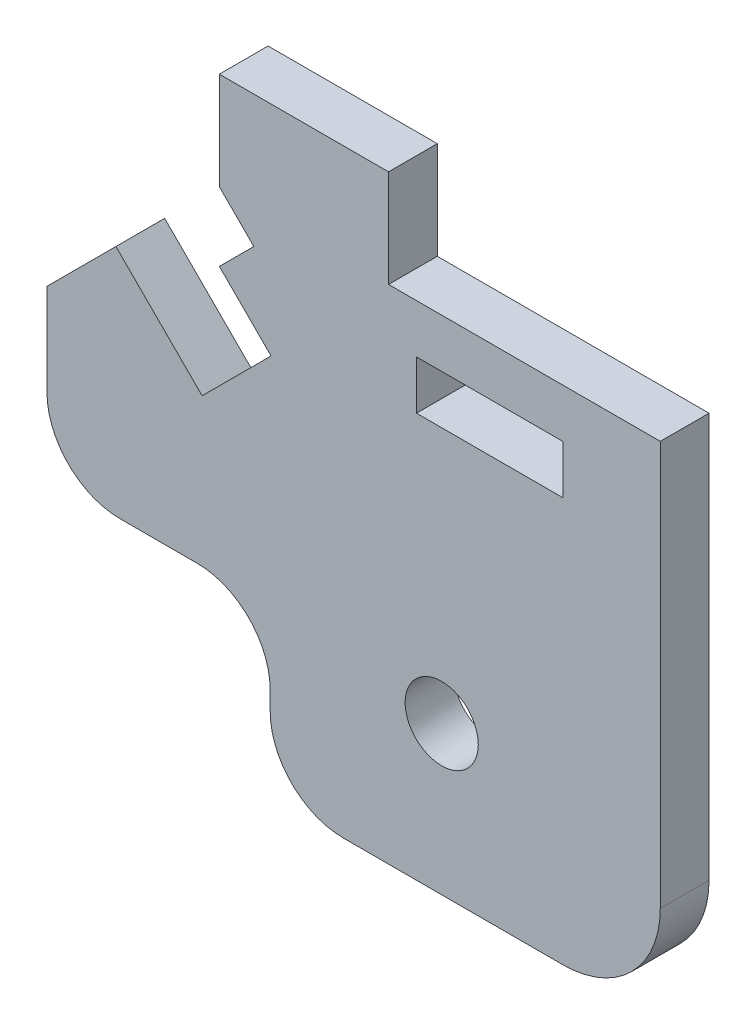
ISO-10303-21;
HEADER;
FILE_DESCRIPTION(('STEP AP214'),'2;1');
FILE_NAME('part.step','',(''),(''),'','','');
FILE_SCHEMA(('AUTOMOTIVE_DESIGN { 1 0 10303 214 1 1 1 1 }'));
ENDSEC;
DATA;
#1=APPLICATION_CONTEXT('core data for automotive mechanical design processes');
#2=APPLICATION_PROTOCOL_DEFINITION('international standard','automotive_design',2000,#1);
#3=PRODUCT_CONTEXT('',#1,'mechanical');
#4=PRODUCT('Part','Part','',(#3));
#5=PRODUCT_RELATED_PRODUCT_CATEGORY('part','',(#4));
#6=PRODUCT_DEFINITION_FORMATION('','',#4);
#7=PRODUCT_DEFINITION_CONTEXT('part definition',#1,'design');
#8=PRODUCT_DEFINITION('design','',#6,#7);
#9=PRODUCT_DEFINITION_SHAPE('','',#8);
#10=(LENGTH_UNIT() NAMED_UNIT(*) SI_UNIT(.MILLI.,.METRE.));
#11=(NAMED_UNIT(*) PLANE_ANGLE_UNIT() SI_UNIT($,.RADIAN.));
#12=(NAMED_UNIT(*) SI_UNIT($,.STERADIAN.) SOLID_ANGLE_UNIT());
#13=UNCERTAINTY_MEASURE_WITH_UNIT(LENGTH_MEASURE(1.E-05),#10,'distance_accuracy_value','');
#14=(GEOMETRIC_REPRESENTATION_CONTEXT(3) GLOBAL_UNCERTAINTY_ASSIGNED_CONTEXT((#13)) GLOBAL_UNIT_ASSIGNED_CONTEXT((#10,
#11,#12)) REPRESENTATION_CONTEXT('',''));
#15=CARTESIAN_POINT('',(0.,0.,0.));
#16=DIRECTION('',(0.,0.,1.));
#17=DIRECTION('',(1.,0.,0.));
#18=AXIS2_PLACEMENT_3D('',#15,#16,#17);
#19=CARTESIAN_POINT('',(21.1568542494928,-7.64136258524606,2.));
#20=DIRECTION('',(0.,0.,1.));
#21=DIRECTION('',(1.,0.,0.));
#22=AXIS2_PLACEMENT_3D('',#19,#20,#21);
#23=PLANE('',#22);
#24=DIRECTION('',(-0.707106781186547,0.707106781186548,0.));
#25=VECTOR('',#24,1.);
#26=CARTESIAN_POINT('',(9.19238815542473,3.99999999999929,2.));
#27=LINE('',#26,#25);
#28=CARTESIAN_POINT('',(9.19238815542473,3.99999999999929,2.));
#29=VERTEX_POINT('',#28);
#30=CARTESIAN_POINT('',(7.07106781186523,6.12132034355878,2.));
#31=VERTEX_POINT('',#30);
#32=EDGE_CURVE('E211',#29,#31,#27,.T.);
#33=ORIENTED_EDGE('',*,*,#32,.F.);
#34=DIRECTION('',(-0.707106781186548,-0.707106781186548,0.));
#35=VECTOR('',#34,1.);
#36=CARTESIAN_POINT('',(6.36396103067849,1.17157287525305,2.));
#37=LINE('',#36,#35);
#38=CARTESIAN_POINT('',(6.36396103067849,1.17157287525305,2.));
#39=VERTEX_POINT('',#38);
#40=EDGE_CURVE('E208',#29,#39,#37,.T.);
#41=ORIENTED_EDGE('',*,*,#40,.T.);
#42=DIRECTION('',(-0.707106781186547,0.707106781186547,0.));
#43=VECTOR('',#42,1.);
#44=CARTESIAN_POINT('',(6.36396103067849,1.17157287525305,2.));
#45=LINE('',#44,#43);
#46=CARTESIAN_POINT('',(2.82842712474585,4.70710678118569,2.));
#47=VERTEX_POINT('',#46);
#48=EDGE_CURVE('E272',#39,#47,#45,.T.);
#49=ORIENTED_EDGE('',*,*,#48,.T.);
#50=DIRECTION('',(-0.707106781186547,-0.707106781186548,0.));
#51=VECTOR('',#50,1.);
#52=CARTESIAN_POINT('',(2.82842712474585,4.70710678118569,2.));
#53=LINE('',#52,#51);
#54=CARTESIAN_POINT('',(-2.66063213127943E-13,1.87867965643957,2.));
#55=VERTEX_POINT('',#54);
#56=EDGE_CURVE('E274',#47,#55,#53,.T.);
#57=ORIENTED_EDGE('',*,*,#56,.T.);
#58=DIRECTION('',(0.,-1.,0.));
#59=VECTOR('',#58,1.);
#60=CARTESIAN_POINT('',(-2.65846372693446E-13,-1.87867965643967,2.));
#61=LINE('',#60,#59);
#62=CARTESIAN_POINT('',(-2.65846372693446E-13,-1.87867965643967,2.));
#63=VERTEX_POINT('',#62);
#64=EDGE_CURVE('E276',#55,#63,#61,.T.);
#65=ORIENTED_EDGE('',*,*,#64,.T.);
#66=CARTESIAN_POINT('',(2.99999999999963,-1.87867965643967,2.));
#67=DIRECTION('',(0.,0.,1.));
#68=DIRECTION('',(1.,0.,0.));
#69=AXIS2_PLACEMENT_3D('',#66,#67,#68);
#70=CIRCLE('',#69,2.99999999999989);
#71=CARTESIAN_POINT('',(2.99999999999963,-4.87867965643956,2.));
#72=VERTEX_POINT('',#71);
#73=EDGE_CURVE('E278',#63,#72,#70,.T.);
#74=ORIENTED_EDGE('',*,*,#73,.T.);
#75=DIRECTION('',(1.,0.,0.));
#76=VECTOR('',#75,1.);
#77=CARTESIAN_POINT('',(2.99999999999963,-4.87867965643956,2.));
#78=LINE('',#77,#76);
#79=CARTESIAN_POINT('',(6.15685424949204,-4.87867965643943,2.));
#80=VERTEX_POINT('',#79);
#81=EDGE_CURVE('E280',#72,#80,#78,.T.);
#82=ORIENTED_EDGE('',*,*,#81,.T.);
#83=CARTESIAN_POINT('',(6.15685424949178,-7.87867965643945,2.));
#84=DIRECTION('',(0.,0.,-1.));
#85=DIRECTION('',(1.,0.,0.));
#86=AXIS2_PLACEMENT_3D('',#83,#84,#85);
#87=CIRCLE('',#86,3.00000000000002);
#88=CARTESIAN_POINT('',(9.15685424949193,-7.87867965643945,2.));
#89=VERTEX_POINT('',#88);
#90=EDGE_CURVE('E282',#80,#89,#87,.T.);
#91=ORIENTED_EDGE('',*,*,#90,.T.);
#92=DIRECTION('',(0.,-1.,0.));
#93=VECTOR('',#92,1.);
#94=CARTESIAN_POINT('',(9.15685424949193,-8.64136258524606,2.));
#95=LINE('',#94,#93);
#96=CARTESIAN_POINT('',(9.15685424949193,-8.64136258524606,2.));
#97=VERTEX_POINT('',#96);
#98=EDGE_CURVE('E284',#89,#97,#95,.T.);
#99=ORIENTED_EDGE('',*,*,#98,.T.);
#100=CARTESIAN_POINT('',(12.1568542494918,-8.64136258524606,2.));
#101=DIRECTION('',(0.,0.,1.));
#102=DIRECTION('',(1.,0.,0.));
#103=AXIS2_PLACEMENT_3D('',#100,#101,#102);
#104=CIRCLE('',#103,2.99999999999989);
#105=CARTESIAN_POINT('',(12.1568542494918,-11.641362585246,2.));
#106=VERTEX_POINT('',#105);
#107=EDGE_CURVE('E286',#97,#106,#104,.T.);
#108=ORIENTED_EDGE('',*,*,#107,.T.);
#109=DIRECTION('',(1.,0.,0.));
#110=VECTOR('',#109,1.);
#111=CARTESIAN_POINT('',(21.1568542494928,-11.641362585246,2.));
#112=LINE('',#111,#110);
#113=CARTESIAN_POINT('',(21.1568542494928,-11.641362585246,2.));
#114=VERTEX_POINT('',#113);
#115=EDGE_CURVE('E288',#106,#114,#112,.T.);
#116=ORIENTED_EDGE('',*,*,#115,.T.);
#117=CARTESIAN_POINT('',(21.1568542494928,-7.64136258524606,2.));
#118=DIRECTION('',(0.,0.,1.));
#119=DIRECTION('',(1.,0.,0.));
#120=AXIS2_PLACEMENT_3D('',#117,#118,#119);
#121=CIRCLE('',#120,3.99999999999989);
#122=CARTESIAN_POINT('',(25.1568542494927,-7.64136258524606,2.));
#123=VERTEX_POINT('',#122);
#124=EDGE_CURVE('E252',#114,#123,#121,.T.);
#125=ORIENTED_EDGE('',*,*,#124,.T.);
#126=DIRECTION('',(0.,1.,0.));
#127=VECTOR('',#126,1.);
#128=CARTESIAN_POINT('',(25.1568542494924,8.94974746830488,2.));
#129=LINE('',#128,#127);
#130=CARTESIAN_POINT('',(25.1568542494924,8.94974746830488,2.));
#131=VERTEX_POINT('',#130);
#132=EDGE_CURVE('E255',#123,#131,#129,.T.);
#133=ORIENTED_EDGE('',*,*,#132,.T.);
#134=DIRECTION('',(-1.,0.,0.));
#135=VECTOR('',#134,1.);
#136=CARTESIAN_POINT('',(14.0104076400849,8.94974746830495,2.));
#137=LINE('',#136,#135);
#138=CARTESIAN_POINT('',(14.0104076400849,8.94974746830495,2.));
#139=VERTEX_POINT('',#138);
#140=EDGE_CURVE('E258',#131,#139,#137,.T.);
#141=ORIENTED_EDGE('',*,*,#140,.T.);
#142=DIRECTION('',(0.,1.,0.));
#143=VECTOR('',#142,1.);
#144=CARTESIAN_POINT('',(14.0104076400849,8.94974746830495,2.));
#145=LINE('',#144,#143);
#146=CARTESIAN_POINT('',(14.0104076400849,12.9497474683048,2.));
#147=VERTEX_POINT('',#146);
#148=EDGE_CURVE('E260',#139,#147,#145,.T.);
#149=ORIENTED_EDGE('',*,*,#148,.T.);
#150=DIRECTION('',(-1.,0.,0.));
#151=VECTOR('',#150,1.);
#152=CARTESIAN_POINT('',(7.07106781186511,12.9497474683048,2.));
#153=LINE('',#152,#151);
#154=CARTESIAN_POINT('',(7.07106781186511,12.9497474683048,2.));
#155=VERTEX_POINT('',#154);
#156=EDGE_CURVE('E262',#147,#155,#153,.T.);
#157=ORIENTED_EDGE('',*,*,#156,.T.);
#158=DIRECTION('',(0.,-1.,0.));
#159=VECTOR('',#158,1.);
#160=CARTESIAN_POINT('',(7.07106781186511,8.94974746830495,2.));
#161=LINE('',#160,#159);
#162=CARTESIAN_POINT('',(7.07106781186511,8.94974746830495,2.));
#163=VERTEX_POINT('',#162);
#164=EDGE_CURVE('E264',#155,#163,#161,.T.);
#165=ORIENTED_EDGE('',*,*,#164,.T.);
#166=DIRECTION('',(0.707106781186548,-0.707106781186547,0.));
#167=VECTOR('',#166,1.);
#168=CARTESIAN_POINT('',(8.48528137423825,7.5355339059318,2.));
#169=LINE('',#168,#167);
#170=CARTESIAN_POINT('',(8.48528137423825,7.5355339059318,2.));
#171=VERTEX_POINT('',#170);
#172=EDGE_CURVE('E266',#163,#171,#169,.T.);
#173=ORIENTED_EDGE('',*,*,#172,.T.);
#174=DIRECTION('',(-0.707106781186547,-0.707106781186547,0.));
#175=VECTOR('',#174,1.);
#176=CARTESIAN_POINT('',(5.65685424949214,4.70710678118569,2.));
#177=LINE('',#176,#175);
#178=EDGE_CURVE('E268',#171,#31,#177,.T.);
#179=ORIENTED_EDGE('',*,*,#178,.T.);
#180=EDGE_LOOP('',(#33,#41,#49,#57,#65,#74,#82,#91,#99,#108,#116,#125,#133,#141,#149,#157,#165,
#173,#179));
#181=FACE_BOUND('',#180,.T.);
#182=CARTESIAN_POINT('',(16.1916874142971,-5.55894635070797,2.));
#183=DIRECTION('',(0.,0.,1.));
#184=DIRECTION('',(1.,0.,0.));
#185=AXIS2_PLACEMENT_3D('',#182,#183,#184);
#186=CIRCLE('',#185,1.50000000000006);
#187=CARTESIAN_POINT('',(17.6916874142972,-5.55894635070797,2.));
#188=VERTEX_POINT('',#187);
#189=EDGE_CURVE('E246',#188,#188,#186,.T.);
#190=ORIENTED_EDGE('',*,*,#189,.F.);
#191=EDGE_LOOP('',(#190));
#192=FACE_BOUND('',#191,.T.);
#193=DIRECTION('',(-1.31838984174245E-13,1.,0.));
#194=VECTOR('',#193,1.);
#195=CARTESIAN_POINT('',(21.1568542494928,4.94974746830634,2.));
#196=LINE('',#195,#194);
#197=CARTESIAN_POINT('',(21.1568542494928,4.94974746830634,2.));
#198=VERTEX_POINT('',#197);
#199=CARTESIAN_POINT('',(21.1568542494925,6.94974746830622,2.));
#200=VERTEX_POINT('',#199);
#201=EDGE_CURVE('E222',#198,#200,#196,.T.);
#202=ORIENTED_EDGE('',*,*,#201,.F.);
#203=DIRECTION('',(1.,0.,0.));
#204=VECTOR('',#203,1.);
#205=CARTESIAN_POINT('',(21.1568542494928,4.94974746830634,2.));
#206=LINE('',#205,#204);
#207=CARTESIAN_POINT('',(15.1568542494917,4.94974746830634,2.));
#208=VERTEX_POINT('',#207);
#209=EDGE_CURVE('E220',#208,#198,#206,.T.);
#210=ORIENTED_EDGE('',*,*,#209,.F.);
#211=DIRECTION('',(-1.31838984174245E-13,-1.,0.));
#212=VECTOR('',#211,1.);
#213=CARTESIAN_POINT('',(15.1568542494917,4.94974746830634,2.));
#214=LINE('',#213,#212);
#215=CARTESIAN_POINT('',(15.156854249492,6.94974746830622,2.));
#216=VERTEX_POINT('',#215);
#217=EDGE_CURVE('E227',#216,#208,#214,.T.);
#218=ORIENTED_EDGE('',*,*,#217,.F.);
#219=DIRECTION('',(-1.,0.,0.));
#220=VECTOR('',#219,1.);
#221=CARTESIAN_POINT('',(15.156854249492,6.94974746830622,2.));
#222=LINE('',#221,#220);
#223=EDGE_CURVE('E225',#200,#216,#222,.T.);
#224=ORIENTED_EDGE('',*,*,#223,.F.);
#225=EDGE_LOOP('',(#202,#210,#218,#224));
#226=FACE_BOUND('',#225,.T.);
#227=ADVANCED_FACE('F33',(#181,#192,#226),#23,.T.);
#228=CARTESIAN_POINT('',(21.1568542494928,-7.64136258524606,0.));
#229=DIRECTION('',(0.,0.,1.));
#230=DIRECTION('',(1.,0.,0.));
#231=AXIS2_PLACEMENT_3D('',#228,#229,#230);
#232=PLANE('',#231);
#233=CARTESIAN_POINT('',(16.1916874142971,-5.55894635070797,0.));
#234=DIRECTION('',(0.,0.,1.));
#235=DIRECTION('',(1.,0.,0.));
#236=AXIS2_PLACEMENT_3D('',#233,#234,#235);
#237=CIRCLE('',#236,1.50000000000006);
#238=CARTESIAN_POINT('',(17.6916874142972,-5.55894635070797,0.));
#239=VERTEX_POINT('',#238);
#240=EDGE_CURVE('E245',#239,#239,#237,.T.);
#241=ORIENTED_EDGE('',*,*,#240,.T.);
#242=EDGE_LOOP('',(#241));
#243=FACE_BOUND('',#242,.T.);
#244=DIRECTION('',(-0.707106781186548,-0.707106781186548,0.));
#245=VECTOR('',#244,1.);
#246=CARTESIAN_POINT('',(6.36396103067849,1.17157287525305,0.));
#247=LINE('',#246,#245);
#248=CARTESIAN_POINT('',(9.19238815542473,3.99999999999929,0.));
#249=VERTEX_POINT('',#248);
#250=CARTESIAN_POINT('',(6.36396103067849,1.17157287525305,0.));
#251=VERTEX_POINT('',#250);
#252=EDGE_CURVE('E190',#249,#251,#247,.T.);
#253=ORIENTED_EDGE('',*,*,#252,.F.);
#254=DIRECTION('',(0.707106781186547,-0.707106781186548,0.));
#255=VECTOR('',#254,1.);
#256=CARTESIAN_POINT('',(9.19238815542473,3.99999999999929,0.));
#257=LINE('',#256,#255);
#258=CARTESIAN_POINT('',(7.07106781186523,6.12132034355878,0.));
#259=VERTEX_POINT('',#258);
#260=EDGE_CURVE('E196',#259,#249,#257,.T.);
#261=ORIENTED_EDGE('',*,*,#260,.F.);
#262=DIRECTION('',(-0.707106781186547,-0.707106781186547,0.));
#263=VECTOR('',#262,1.);
#264=CARTESIAN_POINT('',(5.65685424949214,4.70710678118569,0.));
#265=LINE('',#264,#263);
#266=CARTESIAN_POINT('',(8.48528137423825,7.5355339059318,0.));
#267=VERTEX_POINT('',#266);
#268=EDGE_CURVE('E203',#267,#259,#265,.T.);
#269=ORIENTED_EDGE('',*,*,#268,.F.);
#270=DIRECTION('',(0.707106781186548,-0.707106781186547,0.));
#271=VECTOR('',#270,1.);
#272=CARTESIAN_POINT('',(8.48528137423825,7.5355339059318,0.));
#273=LINE('',#272,#271);
#274=CARTESIAN_POINT('',(7.07106781186511,8.94974746830495,0.));
#275=VERTEX_POINT('',#274);
#276=EDGE_CURVE('E303',#275,#267,#273,.T.);
#277=ORIENTED_EDGE('',*,*,#276,.F.);
#278=DIRECTION('',(0.,-1.,0.));
#279=VECTOR('',#278,1.);
#280=CARTESIAN_POINT('',(7.07106781186511,8.94974746830495,0.));
#281=LINE('',#280,#279);
#282=CARTESIAN_POINT('',(7.07106781186511,12.9497474683048,0.));
#283=VERTEX_POINT('',#282);
#284=EDGE_CURVE('E301',#283,#275,#281,.T.);
#285=ORIENTED_EDGE('',*,*,#284,.F.);
#286=DIRECTION('',(-1.,0.,0.));
#287=VECTOR('',#286,1.);
#288=CARTESIAN_POINT('',(7.07106781186511,12.9497474683048,0.));
#289=LINE('',#288,#287);
#290=CARTESIAN_POINT('',(14.0104076400849,12.9497474683048,0.));
#291=VERTEX_POINT('',#290);
#292=EDGE_CURVE('E299',#291,#283,#289,.T.);
#293=ORIENTED_EDGE('',*,*,#292,.F.);
#294=DIRECTION('',(0.,1.,0.));
#295=VECTOR('',#294,1.);
#296=CARTESIAN_POINT('',(14.0104076400849,8.94974746830495,0.));
#297=LINE('',#296,#295);
#298=CARTESIAN_POINT('',(14.0104076400849,8.94974746830495,0.));
#299=VERTEX_POINT('',#298);
#300=EDGE_CURVE('E297',#299,#291,#297,.T.);
#301=ORIENTED_EDGE('',*,*,#300,.F.);
#302=DIRECTION('',(-1.,0.,0.));
#303=VECTOR('',#302,1.);
#304=CARTESIAN_POINT('',(14.0104076400849,8.94974746830495,0.));
#305=LINE('',#304,#303);
#306=CARTESIAN_POINT('',(25.1568542494924,8.94974746830488,0.));
#307=VERTEX_POINT('',#306);
#308=EDGE_CURVE('E295',#307,#299,#305,.T.);
#309=ORIENTED_EDGE('',*,*,#308,.F.);
#310=DIRECTION('',(0.,1.,0.));
#311=VECTOR('',#310,1.);
#312=CARTESIAN_POINT('',(25.1568542494924,8.94974746830488,0.));
#313=LINE('',#312,#311);
#314=CARTESIAN_POINT('',(25.1568542494927,-7.64136258524606,0.));
#315=VERTEX_POINT('',#314);
#316=EDGE_CURVE('E293',#315,#307,#313,.T.);
#317=ORIENTED_EDGE('',*,*,#316,.F.);
#318=CARTESIAN_POINT('',(21.1568542494928,-7.64136258524606,0.));
#319=DIRECTION('',(0.,0.,1.));
#320=DIRECTION('',(1.,0.,0.));
#321=AXIS2_PLACEMENT_3D('',#318,#319,#320);
#322=CIRCLE('',#321,3.99999999999989);
#323=CARTESIAN_POINT('',(21.1568542494928,-11.641362585246,0.));
#324=VERTEX_POINT('',#323);
#325=EDGE_CURVE('E249',#324,#315,#322,.T.);
#326=ORIENTED_EDGE('',*,*,#325,.F.);
#327=DIRECTION('',(1.,0.,0.));
#328=VECTOR('',#327,1.);
#329=CARTESIAN_POINT('',(21.1568542494928,-11.641362585246,0.));
#330=LINE('',#329,#328);
#331=CARTESIAN_POINT('',(12.1568542494918,-11.641362585246,0.));
#332=VERTEX_POINT('',#331);
#333=EDGE_CURVE('E256',#332,#324,#330,.T.);
#334=ORIENTED_EDGE('',*,*,#333,.F.);
#335=CARTESIAN_POINT('',(12.1568542494918,-8.64136258524606,0.));
#336=DIRECTION('',(0.,0.,1.));
#337=DIRECTION('',(1.,0.,0.));
#338=AXIS2_PLACEMENT_3D('',#335,#336,#337);
#339=CIRCLE('',#338,2.99999999999989);
#340=CARTESIAN_POINT('',(9.15685424949193,-8.64136258524606,0.));
#341=VERTEX_POINT('',#340);
#342=EDGE_CURVE('E320',#341,#332,#339,.T.);
#343=ORIENTED_EDGE('',*,*,#342,.F.);
#344=DIRECTION('',(0.,-1.,0.));
#345=VECTOR('',#344,1.);
#346=CARTESIAN_POINT('',(9.15685424949193,-8.64136258524606,0.));
#347=LINE('',#346,#345);
#348=CARTESIAN_POINT('',(9.15685424949193,-7.87867965643945,0.));
#349=VERTEX_POINT('',#348);
#350=EDGE_CURVE('E318',#349,#341,#347,.T.);
#351=ORIENTED_EDGE('',*,*,#350,.F.);
#352=CARTESIAN_POINT('',(6.15685424949178,-7.87867965643945,0.));
#353=DIRECTION('',(0.,0.,-1.));
#354=DIRECTION('',(1.,0.,0.));
#355=AXIS2_PLACEMENT_3D('',#352,#353,#354);
#356=CIRCLE('',#355,3.00000000000002);
#357=CARTESIAN_POINT('',(6.15685424949204,-4.87867965643943,0.));
#358=VERTEX_POINT('',#357);
#359=EDGE_CURVE('E316',#358,#349,#356,.T.);
#360=ORIENTED_EDGE('',*,*,#359,.F.);
#361=DIRECTION('',(1.,0.,0.));
#362=VECTOR('',#361,1.);
#363=CARTESIAN_POINT('',(6.15685424949204,-4.87867965643956,0.));
#364=LINE('',#363,#362);
#365=CARTESIAN_POINT('',(2.99999999999963,-4.87867965643956,0.));
#366=VERTEX_POINT('',#365);
#367=EDGE_CURVE('E314',#366,#358,#364,.T.);
#368=ORIENTED_EDGE('',*,*,#367,.F.);
#369=CARTESIAN_POINT('',(2.99999999999963,-1.87867965643967,0.));
#370=DIRECTION('',(0.,0.,1.));
#371=DIRECTION('',(1.,0.,0.));
#372=AXIS2_PLACEMENT_3D('',#369,#370,#371);
#373=CIRCLE('',#372,2.99999999999989);
#374=CARTESIAN_POINT('',(-2.65846372693446E-13,-1.87867965643967,0.));
#375=VERTEX_POINT('',#374);
#376=EDGE_CURVE('E311',#375,#366,#373,.T.);
#377=ORIENTED_EDGE('',*,*,#376,.F.);
#378=DIRECTION('',(0.,-1.,0.));
#379=VECTOR('',#378,1.);
#380=CARTESIAN_POINT('',(-2.65846372693446E-13,-1.87867965643967,0.));
#381=LINE('',#380,#379);
#382=CARTESIAN_POINT('',(-2.66063213127943E-13,1.87867965643957,0.));
#383=VERTEX_POINT('',#382);
#384=EDGE_CURVE('E309',#383,#375,#381,.T.);
#385=ORIENTED_EDGE('',*,*,#384,.F.);
#386=DIRECTION('',(-0.707106781186547,-0.707106781186548,0.));
#387=VECTOR('',#386,1.);
#388=CARTESIAN_POINT('',(2.82842712474585,4.70710678118569,0.));
#389=LINE('',#388,#387);
#390=CARTESIAN_POINT('',(2.82842712474585,4.70710678118569,0.));
#391=VERTEX_POINT('',#390);
#392=EDGE_CURVE('E307',#391,#383,#389,.T.);
#393=ORIENTED_EDGE('',*,*,#392,.F.);
#394=DIRECTION('',(-0.707106781186547,0.707106781186547,0.));
#395=VECTOR('',#394,1.);
#396=CARTESIAN_POINT('',(6.36396103067849,1.17157287525305,0.));
#397=LINE('',#396,#395);
#398=EDGE_CURVE('E199',#251,#391,#397,.T.);
#399=ORIENTED_EDGE('',*,*,#398,.F.);
#400=EDGE_LOOP('',(#253,#261,#269,#277,#285,#293,#301,#309,#317,#326,#334,#343,#351,#360,#368,
#377,#385,#393,#399));
#401=FACE_BOUND('',#400,.T.);
#402=DIRECTION('',(1.,0.,0.));
#403=VECTOR('',#402,1.);
#404=CARTESIAN_POINT('',(21.1568542494928,4.94974746830634,0.));
#405=LINE('',#404,#403);
#406=CARTESIAN_POINT('',(15.1568542494917,4.94974746830634,0.));
#407=VERTEX_POINT('',#406);
#408=CARTESIAN_POINT('',(21.1568542494928,4.94974746830634,0.));
#409=VERTEX_POINT('',#408);
#410=EDGE_CURVE('E56',#407,#409,#405,.T.);
#411=ORIENTED_EDGE('',*,*,#410,.T.);
#412=DIRECTION('',(-1.31838984174245E-13,1.,0.));
#413=VECTOR('',#412,1.);
#414=CARTESIAN_POINT('',(21.1568542494928,4.94974746830634,0.));
#415=LINE('',#414,#413);
#416=CARTESIAN_POINT('',(21.1568542494925,6.94974746830622,0.));
#417=VERTEX_POINT('',#416);
#418=EDGE_CURVE('E231',#409,#417,#415,.T.);
#419=ORIENTED_EDGE('',*,*,#418,.T.);
#420=DIRECTION('',(-1.,0.,0.));
#421=VECTOR('',#420,1.);
#422=CARTESIAN_POINT('',(15.156854249492,6.94974746830622,0.));
#423=LINE('',#422,#421);
#424=CARTESIAN_POINT('',(15.156854249492,6.94974746830622,0.));
#425=VERTEX_POINT('',#424);
#426=EDGE_CURVE('E234',#417,#425,#423,.T.);
#427=ORIENTED_EDGE('',*,*,#426,.T.);
#428=DIRECTION('',(-1.31838984174245E-13,-1.,0.));
#429=VECTOR('',#428,1.);
#430=CARTESIAN_POINT('',(15.1568542494917,4.94974746830634,0.));
#431=LINE('',#430,#429);
#432=EDGE_CURVE('E223',#425,#407,#431,.T.);
#433=ORIENTED_EDGE('',*,*,#432,.T.);
#434=EDGE_LOOP('',(#411,#419,#427,#433));
#435=FACE_BOUND('',#434,.T.);
#436=ADVANCED_FACE('F192',(#243,#401,#435),#232,.F.);
#437=CARTESIAN_POINT('',(21.1568542494928,-7.64136258524606,2.));
#438=DIRECTION('',(0.,0.,-1.));
#439=DIRECTION('',(-1.,0.,0.));
#440=AXIS2_PLACEMENT_3D('',#437,#438,#439);
#441=CYLINDRICAL_SURFACE('',#440,3.99999999999989);
#442=ORIENTED_EDGE('',*,*,#325,.T.);
#443=DIRECTION('',(0.,0.,-1.));
#444=VECTOR('',#443,1.);
#445=CARTESIAN_POINT('',(25.1568542494927,-7.64136258524606,2.));
#446=LINE('',#445,#444);
#447=EDGE_CURVE('E11',#123,#315,#446,.T.);
#448=ORIENTED_EDGE('',*,*,#447,.F.);
#449=ORIENTED_EDGE('',*,*,#124,.F.);
#450=DIRECTION('',(0.,0.,-1.));
#451=VECTOR('',#450,1.);
#452=CARTESIAN_POINT('',(21.1568542494928,-11.641362585246,2.));
#453=LINE('',#452,#451);
#454=EDGE_CURVE('E290',#114,#324,#453,.T.);
#455=ORIENTED_EDGE('',*,*,#454,.T.);
#456=EDGE_LOOP('',(#442,#448,#449,#455));
#457=FACE_BOUND('',#456,.T.);
#458=ADVANCED_FACE('F35',(#457),#441,.T.);
#459=CARTESIAN_POINT('',(25.1568542494924,8.94974746830488,2.));
#460=DIRECTION('',(-1.,0.,0.));
#461=DIRECTION('',(0.,-1.,0.));
#462=AXIS2_PLACEMENT_3D('',#459,#460,#461);
#463=PLANE('',#462);
#464=ORIENTED_EDGE('',*,*,#316,.T.);
#465=DIRECTION('',(0.,0.,-1.));
#466=VECTOR('',#465,1.);
#467=CARTESIAN_POINT('',(25.1568542494924,8.94974746830488,2.));
#468=LINE('',#467,#466);
#469=EDGE_CURVE('E41',#131,#307,#468,.T.);
#470=ORIENTED_EDGE('',*,*,#469,.F.);
#471=ORIENTED_EDGE('',*,*,#132,.F.);
#472=ORIENTED_EDGE('',*,*,#447,.T.);
#473=EDGE_LOOP('',(#464,#470,#471,#472));
#474=FACE_BOUND('',#473,.T.);
#475=ADVANCED_FACE('F391',(#474),#463,.F.);
#476=CARTESIAN_POINT('',(14.0104076400849,8.94974746830495,2.));
#477=DIRECTION('',(0.,-1.,0.));
#478=DIRECTION('',(1.,0.,0.));
#479=AXIS2_PLACEMENT_3D('',#476,#477,#478);
#480=PLANE('',#479);
#481=ORIENTED_EDGE('',*,*,#308,.T.);
#482=DIRECTION('',(0.,0.,-1.));
#483=VECTOR('',#482,1.);
#484=CARTESIAN_POINT('',(14.0104076400849,8.94974746830495,2.));
#485=LINE('',#484,#483);
#486=EDGE_CURVE('E363',#139,#299,#485,.T.);
#487=ORIENTED_EDGE('',*,*,#486,.F.);
#488=ORIENTED_EDGE('',*,*,#140,.F.);
#489=ORIENTED_EDGE('',*,*,#469,.T.);
#490=EDGE_LOOP('',(#481,#487,#488,#489));
#491=FACE_BOUND('',#490,.T.);
#492=ADVANCED_FACE('F370',(#491),#480,.F.);
#493=CARTESIAN_POINT('',(14.0104076400849,8.94974746830495,2.));
#494=DIRECTION('',(-1.,0.,0.));
#495=DIRECTION('',(0.,0.,1.));
#496=AXIS2_PLACEMENT_3D('',#493,#494,#495);
#497=PLANE('',#496);
#498=ORIENTED_EDGE('',*,*,#300,.T.);
#499=DIRECTION('',(0.,0.,-1.));
#500=VECTOR('',#499,1.);
#501=CARTESIAN_POINT('',(14.0104076400849,12.9497474683048,2.));
#502=LINE('',#501,#500);
#503=EDGE_CURVE('E360',#147,#291,#502,.T.);
#504=ORIENTED_EDGE('',*,*,#503,.F.);
#505=ORIENTED_EDGE('',*,*,#148,.F.);
#506=ORIENTED_EDGE('',*,*,#486,.T.);
#507=EDGE_LOOP('',(#498,#504,#505,#506));
#508=FACE_BOUND('',#507,.T.);
#509=ADVANCED_FACE('F379',(#508),#497,.F.);
#510=CARTESIAN_POINT('',(7.07106781186511,12.9497474683048,2.));
#511=DIRECTION('',(0.,-1.,0.));
#512=DIRECTION('',(0.,0.,-1.));
#513=AXIS2_PLACEMENT_3D('',#510,#511,#512);
#514=PLANE('',#513);
#515=ORIENTED_EDGE('',*,*,#292,.T.);
#516=DIRECTION('',(0.,0.,-1.));
#517=VECTOR('',#516,1.);
#518=CARTESIAN_POINT('',(7.07106781186511,12.9497474683048,2.));
#519=LINE('',#518,#517);
#520=EDGE_CURVE('E357',#155,#283,#519,.T.);
#521=ORIENTED_EDGE('',*,*,#520,.F.);
#522=ORIENTED_EDGE('',*,*,#156,.F.);
#523=ORIENTED_EDGE('',*,*,#503,.T.);
#524=EDGE_LOOP('',(#515,#521,#522,#523));
#525=FACE_BOUND('',#524,.T.);
#526=ADVANCED_FACE('F383',(#525),#514,.F.);
#527=CARTESIAN_POINT('',(7.07106781186511,8.94974746830495,2.));
#528=DIRECTION('',(1.,0.,0.));
#529=DIRECTION('',(0.,0.,-1.));
#530=AXIS2_PLACEMENT_3D('',#527,#528,#529);
#531=PLANE('',#530);
#532=ORIENTED_EDGE('',*,*,#284,.T.);
#533=DIRECTION('',(0.,0.,-1.));
#534=VECTOR('',#533,1.);
#535=CARTESIAN_POINT('',(7.07106781186511,8.94974746830495,2.));
#536=LINE('',#535,#534);
#537=EDGE_CURVE('E354',#163,#275,#536,.T.);
#538=ORIENTED_EDGE('',*,*,#537,.F.);
#539=ORIENTED_EDGE('',*,*,#164,.F.);
#540=ORIENTED_EDGE('',*,*,#520,.T.);
#541=EDGE_LOOP('',(#532,#538,#539,#540));
#542=FACE_BOUND('',#541,.T.);
#543=ADVANCED_FACE('F444',(#542),#531,.F.);
#544=CARTESIAN_POINT('',(8.48528137423825,7.5355339059318,2.));
#545=DIRECTION('',(0.707106781186547,0.707106781186548,0.));
#546=DIRECTION('',(-0.707106781186548,0.707106781186547,0.));
#547=AXIS2_PLACEMENT_3D('',#544,#545,#546);
#548=PLANE('',#547);
#549=ORIENTED_EDGE('',*,*,#276,.T.);
#550=DIRECTION('',(0.,0.,-1.));
#551=VECTOR('',#550,1.);
#552=CARTESIAN_POINT('',(8.48528137423825,7.5355339059318,2.));
#553=LINE('',#552,#551);
#554=EDGE_CURVE('E351',#171,#267,#553,.T.);
#555=ORIENTED_EDGE('',*,*,#554,.F.);
#556=ORIENTED_EDGE('',*,*,#172,.F.);
#557=ORIENTED_EDGE('',*,*,#537,.T.);
#558=EDGE_LOOP('',(#549,#555,#556,#557));
#559=FACE_BOUND('',#558,.T.);
#560=ADVANCED_FACE('F441',(#559),#548,.F.);
#561=CARTESIAN_POINT('',(5.65685424949214,4.70710678118569,2.));
#562=DIRECTION('',(0.707106781186547,-0.707106781186547,0.));
#563=DIRECTION('',(0.707106781186548,0.707106781186548,0.));
#564=AXIS2_PLACEMENT_3D('',#561,#562,#563);
#565=PLANE('',#564);
#566=ORIENTED_EDGE('',*,*,#268,.T.);
#567=DIRECTION('',(0.,0.,-1.));
#568=VECTOR('',#567,1.);
#569=CARTESIAN_POINT('',(7.07106781186523,6.12132034355878,0.));
#570=LINE('',#569,#568);
#571=EDGE_CURVE('E215',#31,#259,#570,.T.);
#572=ORIENTED_EDGE('',*,*,#571,.F.);
#573=ORIENTED_EDGE('',*,*,#178,.F.);
#574=ORIENTED_EDGE('',*,*,#554,.T.);
#575=EDGE_LOOP('',(#566,#572,#573,#574));
#576=FACE_BOUND('',#575,.T.);
#577=ADVANCED_FACE('F437',(#576),#565,.F.);
#578=CARTESIAN_POINT('',(6.36396103067849,1.17157287525305,2.));
#579=DIRECTION('',(0.707106781186547,-0.707106781186547,0.));
#580=DIRECTION('',(0.707106781186548,0.707106781186548,0.));
#581=AXIS2_PLACEMENT_3D('',#578,#579,#580);
#582=PLANE('',#581);
#583=ORIENTED_EDGE('',*,*,#252,.T.);
#584=DIRECTION('',(0.,0.,-1.));
#585=VECTOR('',#584,1.);
#586=CARTESIAN_POINT('',(6.36396103067849,1.17157287525305,2.));
#587=LINE('',#586,#585);
#588=EDGE_CURVE('E349',#39,#251,#587,.T.);
#589=ORIENTED_EDGE('',*,*,#588,.F.);
#590=ORIENTED_EDGE('',*,*,#40,.F.);
#591=DIRECTION('',(0.,0.,1.));
#592=VECTOR('',#591,1.);
#593=CARTESIAN_POINT('',(9.19238815542473,3.99999999999929,0.));
#594=LINE('',#593,#592);
#595=EDGE_CURVE('E206',#249,#29,#594,.T.);
#596=ORIENTED_EDGE('',*,*,#595,.F.);
#597=EDGE_LOOP('',(#583,#589,#590,#596));
#598=FACE_BOUND('',#597,.T.);
#599=ADVANCED_FACE('F207',(#598),#582,.F.);
#600=CARTESIAN_POINT('',(6.36396103067849,1.17157287525305,2.));
#601=DIRECTION('',(-0.707106781186547,-0.707106781186547,0.));
#602=DIRECTION('',(0.707106781186548,-0.707106781186548,0.));
#603=AXIS2_PLACEMENT_3D('',#600,#601,#602);
#604=PLANE('',#603);
#605=ORIENTED_EDGE('',*,*,#398,.T.);
#606=DIRECTION('',(0.,0.,-1.));
#607=VECTOR('',#606,1.);
#608=CARTESIAN_POINT('',(2.82842712474585,4.70710678118569,2.));
#609=LINE('',#608,#607);
#610=EDGE_CURVE('E346',#47,#391,#609,.T.);
#611=ORIENTED_EDGE('',*,*,#610,.F.);
#612=ORIENTED_EDGE('',*,*,#48,.F.);
#613=ORIENTED_EDGE('',*,*,#588,.T.);
#614=EDGE_LOOP('',(#605,#611,#612,#613));
#615=FACE_BOUND('',#614,.T.);
#616=ADVANCED_FACE('F434',(#615),#604,.F.);
#617=CARTESIAN_POINT('',(2.82842712474585,4.70710678118569,2.));
#618=DIRECTION('',(0.707106781186548,-0.707106781186547,0.));
#619=DIRECTION('',(0.707106781186547,0.707106781186548,0.));
#620=AXIS2_PLACEMENT_3D('',#617,#618,#619);
#621=PLANE('',#620);
#622=ORIENTED_EDGE('',*,*,#392,.T.);
#623=DIRECTION('',(0.,0.,-1.));
#624=VECTOR('',#623,1.);
#625=CARTESIAN_POINT('',(-2.66063213127943E-13,1.87867965643957,2.));
#626=LINE('',#625,#624);
#627=EDGE_CURVE('E343',#55,#383,#626,.T.);
#628=ORIENTED_EDGE('',*,*,#627,.F.);
#629=ORIENTED_EDGE('',*,*,#56,.F.);
#630=ORIENTED_EDGE('',*,*,#610,.T.);
#631=EDGE_LOOP('',(#622,#628,#629,#630));
#632=FACE_BOUND('',#631,.T.);
#633=ADVANCED_FACE('F430',(#632),#621,.F.);
#634=CARTESIAN_POINT('',(-2.65846372693446E-13,-1.87867965643967,2.));
#635=DIRECTION('',(1.,0.,0.));
#636=DIRECTION('',(0.,1.,0.));
#637=AXIS2_PLACEMENT_3D('',#634,#635,#636);
#638=PLANE('',#637);
#639=ORIENTED_EDGE('',*,*,#384,.T.);
#640=DIRECTION('',(0.,0.,-1.));
#641=VECTOR('',#640,1.);
#642=CARTESIAN_POINT('',(-2.65846372693446E-13,-1.87867965643967,2.));
#643=LINE('',#642,#641);
#644=EDGE_CURVE('E340',#63,#375,#643,.T.);
#645=ORIENTED_EDGE('',*,*,#644,.F.);
#646=ORIENTED_EDGE('',*,*,#64,.F.);
#647=ORIENTED_EDGE('',*,*,#627,.T.);
#648=EDGE_LOOP('',(#639,#645,#646,#647));
#649=FACE_BOUND('',#648,.T.);
#650=ADVANCED_FACE('F425',(#649),#638,.F.);
#651=CARTESIAN_POINT('',(2.99999999999963,-1.87867965643967,2.));
#652=DIRECTION('',(0.,0.,-1.));
#653=DIRECTION('',(-1.,0.,0.));
#654=AXIS2_PLACEMENT_3D('',#651,#652,#653);
#655=CYLINDRICAL_SURFACE('',#654,2.99999999999989);
#656=ORIENTED_EDGE('',*,*,#376,.T.);
#657=DIRECTION('',(0.,0.,-1.));
#658=VECTOR('',#657,1.);
#659=CARTESIAN_POINT('',(2.99999999999963,-4.87867965643956,2.));
#660=LINE('',#659,#658);
#661=EDGE_CURVE('E337',#72,#366,#660,.T.);
#662=ORIENTED_EDGE('',*,*,#661,.F.);
#663=ORIENTED_EDGE('',*,*,#73,.F.);
#664=ORIENTED_EDGE('',*,*,#644,.T.);
#665=EDGE_LOOP('',(#656,#662,#663,#664));
#666=FACE_BOUND('',#665,.T.);
#667=ADVANCED_FACE('F421',(#666),#655,.T.);
#668=CARTESIAN_POINT('',(6.15685424949204,-4.87867965643956,2.));
#669=DIRECTION('',(0.,1.,0.));
#670=DIRECTION('',(0.,0.,1.));
#671=AXIS2_PLACEMENT_3D('',#668,#669,#670);
#672=PLANE('',#671);
#673=ORIENTED_EDGE('',*,*,#367,.T.);
#674=DIRECTION('',(0.,0.,-1.));
#675=VECTOR('',#674,1.);
#676=CARTESIAN_POINT('',(6.15685424949204,-4.87867965643943,2.));
#677=LINE('',#676,#675);
#678=EDGE_CURVE('E334',#80,#358,#677,.T.);
#679=ORIENTED_EDGE('',*,*,#678,.F.);
#680=ORIENTED_EDGE('',*,*,#81,.F.);
#681=ORIENTED_EDGE('',*,*,#661,.T.);
#682=EDGE_LOOP('',(#673,#679,#680,#681));
#683=FACE_BOUND('',#682,.T.);
#684=ADVANCED_FACE('F417',(#683),#672,.F.);
#685=CARTESIAN_POINT('',(6.15685424949178,-7.87867965643945,2.));
#686=DIRECTION('',(0.,0.,-1.));
#687=DIRECTION('',(-1.,0.,0.));
#688=AXIS2_PLACEMENT_3D('',#685,#686,#687);
#689=CYLINDRICAL_SURFACE('',#688,3.00000000000002);
#690=ORIENTED_EDGE('',*,*,#359,.T.);
#691=DIRECTION('',(0.,0.,-1.));
#692=VECTOR('',#691,1.);
#693=CARTESIAN_POINT('',(9.15685424949193,-7.87867965643945,2.));
#694=LINE('',#693,#692);
#695=EDGE_CURVE('E331',#89,#349,#694,.T.);
#696=ORIENTED_EDGE('',*,*,#695,.F.);
#697=ORIENTED_EDGE('',*,*,#90,.F.);
#698=ORIENTED_EDGE('',*,*,#678,.T.);
#699=EDGE_LOOP('',(#690,#696,#697,#698));
#700=FACE_BOUND('',#699,.T.);
#701=ADVANCED_FACE('F412',(#700),#689,.F.);
#702=CARTESIAN_POINT('',(9.15685424949193,-8.64136258524606,2.));
#703=DIRECTION('',(1.,0.,0.));
#704=DIRECTION('',(0.,0.,-1.));
#705=AXIS2_PLACEMENT_3D('',#702,#703,#704);
#706=PLANE('',#705);
#707=ORIENTED_EDGE('',*,*,#350,.T.);
#708=DIRECTION('',(0.,0.,-1.));
#709=VECTOR('',#708,1.);
#710=CARTESIAN_POINT('',(9.15685424949193,-8.64136258524606,2.));
#711=LINE('',#710,#709);
#712=EDGE_CURVE('E328',#97,#341,#711,.T.);
#713=ORIENTED_EDGE('',*,*,#712,.F.);
#714=ORIENTED_EDGE('',*,*,#98,.F.);
#715=ORIENTED_EDGE('',*,*,#695,.T.);
#716=EDGE_LOOP('',(#707,#713,#714,#715));
#717=FACE_BOUND('',#716,.T.);
#718=ADVANCED_FACE('F407',(#717),#706,.F.);
#719=CARTESIAN_POINT('',(12.1568542494918,-8.64136258524606,2.));
#720=DIRECTION('',(0.,0.,-1.));
#721=DIRECTION('',(-1.,0.,0.));
#722=AXIS2_PLACEMENT_3D('',#719,#720,#721);
#723=CYLINDRICAL_SURFACE('',#722,2.99999999999989);
#724=ORIENTED_EDGE('',*,*,#342,.T.);
#725=DIRECTION('',(0.,0.,-1.));
#726=VECTOR('',#725,1.);
#727=CARTESIAN_POINT('',(12.1568542494918,-11.641362585246,2.));
#728=LINE('',#727,#726);
#729=EDGE_CURVE('E325',#106,#332,#728,.T.);
#730=ORIENTED_EDGE('',*,*,#729,.F.);
#731=ORIENTED_EDGE('',*,*,#107,.F.);
#732=ORIENTED_EDGE('',*,*,#712,.T.);
#733=EDGE_LOOP('',(#724,#730,#731,#732));
#734=FACE_BOUND('',#733,.T.);
#735=ADVANCED_FACE('F403',(#734),#723,.T.);
#736=CARTESIAN_POINT('',(21.1568542494928,-11.641362585246,2.));
#737=DIRECTION('',(0.,1.,0.));
#738=DIRECTION('',(0.,0.,1.));
#739=AXIS2_PLACEMENT_3D('',#736,#737,#738);
#740=PLANE('',#739);
#741=ORIENTED_EDGE('',*,*,#333,.T.);
#742=ORIENTED_EDGE('',*,*,#454,.F.);
#743=ORIENTED_EDGE('',*,*,#115,.F.);
#744=ORIENTED_EDGE('',*,*,#729,.T.);
#745=EDGE_LOOP('',(#741,#742,#743,#744));
#746=FACE_BOUND('',#745,.T.);
#747=ADVANCED_FACE('F398',(#746),#740,.F.);
#748=CARTESIAN_POINT('',(16.1916874142971,-5.55894635070797,2.));
#749=DIRECTION('',(0.,0.,-1.));
#750=DIRECTION('',(-1.,0.,0.));
#751=AXIS2_PLACEMENT_3D('',#748,#749,#750);
#752=CYLINDRICAL_SURFACE('',#751,1.50000000000006);
#753=ORIENTED_EDGE('',*,*,#189,.T.);
#754=EDGE_LOOP('',(#753));
#755=FACE_BOUND('',#754,.T.);
#756=ORIENTED_EDGE('',*,*,#240,.F.);
#757=EDGE_LOOP('',(#756));
#758=FACE_BOUND('',#757,.T.);
#759=ADVANCED_FACE('F461',(#755,#758),#752,.F.);
#760=CARTESIAN_POINT('',(21.1568542494928,4.94974746830634,2.));
#761=DIRECTION('',(0.,1.,0.));
#762=DIRECTION('',(-1.,0.,0.));
#763=AXIS2_PLACEMENT_3D('',#760,#761,#762);
#764=PLANE('',#763);
#765=ORIENTED_EDGE('',*,*,#410,.F.);
#766=DIRECTION('',(0.,0.,-1.));
#767=VECTOR('',#766,1.);
#768=CARTESIAN_POINT('',(15.1568542494917,4.94974746830634,2.));
#769=LINE('',#768,#767);
#770=EDGE_CURVE('E229',#208,#407,#769,.T.);
#771=ORIENTED_EDGE('',*,*,#770,.F.);
#772=ORIENTED_EDGE('',*,*,#209,.T.);
#773=DIRECTION('',(0.,0.,-1.));
#774=VECTOR('',#773,1.);
#775=CARTESIAN_POINT('',(21.1568542494928,4.94974746830634,2.));
#776=LINE('',#775,#774);
#777=EDGE_CURVE('E243',#198,#409,#776,.T.);
#778=ORIENTED_EDGE('',*,*,#777,.T.);
#779=EDGE_LOOP('',(#765,#771,#772,#778));
#780=FACE_BOUND('',#779,.T.);
#781=ADVANCED_FACE('F537',(#780),#764,.T.);
#782=CARTESIAN_POINT('',(21.1568542494928,4.94974746830634,2.));
#783=DIRECTION('',(-1.,-1.31838984174245E-13,0.));
#784=DIRECTION('',(1.31838984174245E-13,-1.,0.));
#785=AXIS2_PLACEMENT_3D('',#782,#783,#784);
#786=PLANE('',#785);
#787=ORIENTED_EDGE('',*,*,#418,.F.);
#788=ORIENTED_EDGE('',*,*,#777,.F.);
#789=ORIENTED_EDGE('',*,*,#201,.T.);
#790=DIRECTION('',(0.,0.,-1.));
#791=VECTOR('',#790,1.);
#792=CARTESIAN_POINT('',(21.1568542494925,6.94974746830622,2.));
#793=LINE('',#792,#791);
#794=EDGE_CURVE('E241',#200,#417,#793,.T.);
#795=ORIENTED_EDGE('',*,*,#794,.T.);
#796=EDGE_LOOP('',(#787,#788,#789,#795));
#797=FACE_BOUND('',#796,.T.);
#798=ADVANCED_FACE('F544',(#797),#786,.T.);
#799=CARTESIAN_POINT('',(15.156854249492,6.94974746830622,2.));
#800=DIRECTION('',(0.,-1.,0.));
#801=DIRECTION('',(0.,0.,-1.));
#802=AXIS2_PLACEMENT_3D('',#799,#800,#801);
#803=PLANE('',#802);
#804=ORIENTED_EDGE('',*,*,#426,.F.);
#805=ORIENTED_EDGE('',*,*,#794,.F.);
#806=ORIENTED_EDGE('',*,*,#223,.T.);
#807=DIRECTION('',(0.,0.,-1.));
#808=VECTOR('',#807,1.);
#809=CARTESIAN_POINT('',(15.156854249492,6.94974746830622,2.));
#810=LINE('',#809,#808);
#811=EDGE_CURVE('E48',#216,#425,#810,.T.);
#812=ORIENTED_EDGE('',*,*,#811,.T.);
#813=EDGE_LOOP('',(#804,#805,#806,#812));
#814=FACE_BOUND('',#813,.T.);
#815=ADVANCED_FACE('F550',(#814),#803,.T.);
#816=CARTESIAN_POINT('',(15.1568542494917,4.94974746830634,2.));
#817=DIRECTION('',(1.,-1.31838984174245E-13,0.));
#818=DIRECTION('',(1.31838984174245E-13,1.,0.));
#819=AXIS2_PLACEMENT_3D('',#816,#817,#818);
#820=PLANE('',#819);
#821=ORIENTED_EDGE('',*,*,#432,.F.);
#822=ORIENTED_EDGE('',*,*,#811,.F.);
#823=ORIENTED_EDGE('',*,*,#217,.T.);
#824=ORIENTED_EDGE('',*,*,#770,.T.);
#825=EDGE_LOOP('',(#821,#822,#823,#824));
#826=FACE_BOUND('',#825,.T.);
#827=ADVANCED_FACE('F558',(#826),#820,.T.);
#828=CARTESIAN_POINT('',(6.59619407771201,6.59619407771201,0.));
#829=DIRECTION('',(0.707106781186548,0.707106781186547,0.));
#830=DIRECTION('',(-0.707106781186547,0.707106781186548,0.));
#831=AXIS2_PLACEMENT_3D('',#828,#829,#830);
#832=PLANE('',#831);
#833=ORIENTED_EDGE('',*,*,#260,.T.);
#834=ORIENTED_EDGE('',*,*,#595,.T.);
#835=ORIENTED_EDGE('',*,*,#32,.T.);
#836=ORIENTED_EDGE('',*,*,#571,.T.);
#837=EDGE_LOOP('',(#833,#834,#835,#836));
#838=FACE_BOUND('',#837,.T.);
#839=ADVANCED_FACE('F213',(#838),#832,.F.);
#840=CLOSED_SHELL('',(#227,#436,#458,#475,#492,#509,#526,#543,#560,#577,#599,#616,#633,#650,
#667,#684,#701,#718,#735,#747,#759,#781,#798,#815,#827,#839));
#841=MANIFOLD_SOLID_BREP('B2',#840);
#842=ADVANCED_BREP_SHAPE_REPRESENTATION('',(#18,#841),#14);
#843=SHAPE_DEFINITION_REPRESENTATION(#9,#842);
ENDSEC;
END-ISO-10303-21;
